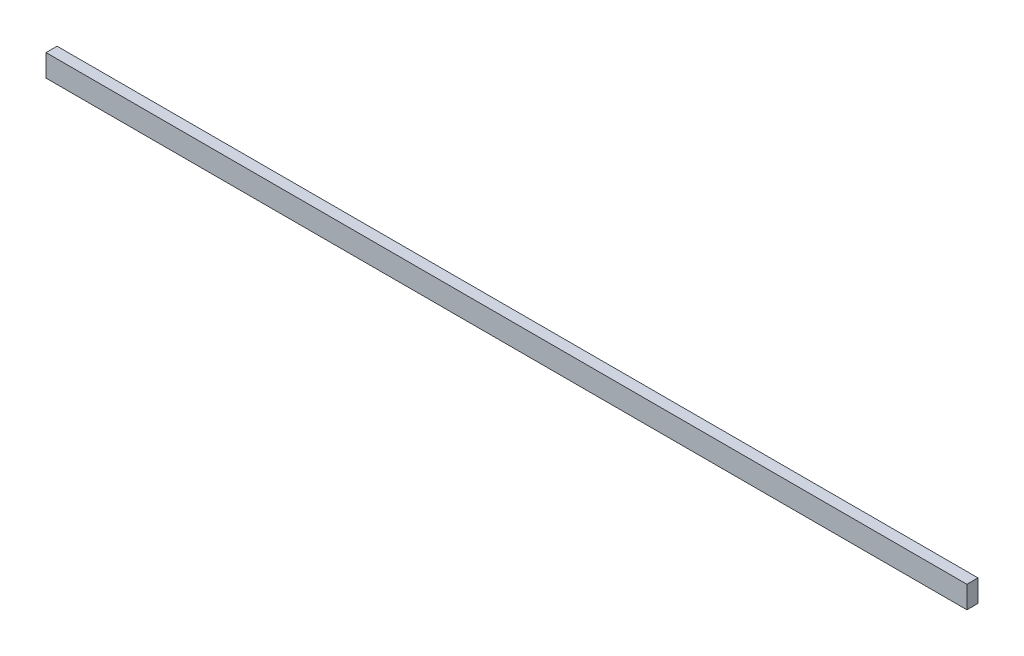
ISO-10303-21;
HEADER;
FILE_DESCRIPTION(('STEP AP214'),'2;1');
FILE_NAME('part.step','',(''),(''),'','','');
FILE_SCHEMA(('AUTOMOTIVE_DESIGN { 1 0 10303 214 1 1 1 1 }'));
ENDSEC;
DATA;
#1=APPLICATION_CONTEXT('core data for automotive mechanical design processes');
#2=APPLICATION_PROTOCOL_DEFINITION('international standard','automotive_design',2000,#1);
#3=PRODUCT_CONTEXT('',#1,'mechanical');
#4=PRODUCT('Part','Part','',(#3));
#5=PRODUCT_RELATED_PRODUCT_CATEGORY('part','',(#4));
#6=PRODUCT_DEFINITION_FORMATION('','',#4);
#7=PRODUCT_DEFINITION_CONTEXT('part definition',#1,'design');
#8=PRODUCT_DEFINITION('design','',#6,#7);
#9=PRODUCT_DEFINITION_SHAPE('','',#8);
#10=(LENGTH_UNIT() NAMED_UNIT(*) SI_UNIT(.MILLI.,.METRE.));
#11=(NAMED_UNIT(*) PLANE_ANGLE_UNIT() SI_UNIT($,.RADIAN.));
#12=(NAMED_UNIT(*) SI_UNIT($,.STERADIAN.) SOLID_ANGLE_UNIT());
#13=UNCERTAINTY_MEASURE_WITH_UNIT(LENGTH_MEASURE(1.E-05),#10,'distance_accuracy_value','');
#14=(GEOMETRIC_REPRESENTATION_CONTEXT(3) GLOBAL_UNCERTAINTY_ASSIGNED_CONTEXT((#13)) GLOBAL_UNIT_ASSIGNED_CONTEXT((#10,
#11,#12)) REPRESENTATION_CONTEXT('',''));
#15=CARTESIAN_POINT('',(0.,0.,0.));
#16=DIRECTION('',(0.,0.,1.));
#17=DIRECTION('',(1.,0.,0.));
#18=AXIS2_PLACEMENT_3D('',#15,#16,#17);
#19=CARTESIAN_POINT('',(208.,5.,5.));
#20=DIRECTION('',(-1.,0.,0.));
#21=DIRECTION('',(0.,0.,1.));
#22=AXIS2_PLACEMENT_3D('',#19,#20,#21);
#23=PLANE('',#22);
#24=DIRECTION('',(0.,1.,0.));
#25=VECTOR('',#24,1.);
#26=CARTESIAN_POINT('',(208.,5.,0.));
#27=LINE('',#26,#25);
#28=CARTESIAN_POINT('',(208.,-5.,0.));
#29=VERTEX_POINT('',#28);
#30=CARTESIAN_POINT('',(208.,5.,0.));
#31=VERTEX_POINT('',#30);
#32=EDGE_CURVE('E96',#29,#31,#27,.T.);
#33=ORIENTED_EDGE('',*,*,#32,.T.);
#34=DIRECTION('',(0.,0.,-1.));
#35=VECTOR('',#34,1.);
#36=CARTESIAN_POINT('',(208.,5.,5.));
#37=LINE('',#36,#35);
#38=CARTESIAN_POINT('',(208.,5.,5.));
#39=VERTEX_POINT('',#38);
#40=EDGE_CURVE('E11',#39,#31,#37,.T.);
#41=ORIENTED_EDGE('',*,*,#40,.F.);
#42=DIRECTION('',(0.,1.,0.));
#43=VECTOR('',#42,1.);
#44=CARTESIAN_POINT('',(208.,5.,5.));
#45=LINE('',#44,#43);
#46=CARTESIAN_POINT('',(208.,-5.,5.));
#47=VERTEX_POINT('',#46);
#48=EDGE_CURVE('E84',#47,#39,#45,.T.);
#49=ORIENTED_EDGE('',*,*,#48,.F.);
#50=DIRECTION('',(0.,0.,-1.));
#51=VECTOR('',#50,1.);
#52=CARTESIAN_POINT('',(208.,-5.,5.));
#53=LINE('',#52,#51);
#54=EDGE_CURVE('E92',#47,#29,#53,.T.);
#55=ORIENTED_EDGE('',*,*,#54,.T.);
#56=EDGE_LOOP('',(#33,#41,#49,#55));
#57=FACE_BOUND('',#56,.T.);
#58=ADVANCED_FACE('F33',(#57),#23,.F.);
#59=CARTESIAN_POINT('',(-208.,5.,5.));
#60=DIRECTION('',(0.,-1.,0.));
#61=DIRECTION('',(0.,0.,-1.));
#62=AXIS2_PLACEMENT_3D('',#59,#60,#61);
#63=PLANE('',#62);
#64=DIRECTION('',(-1.,0.,0.));
#65=VECTOR('',#64,1.);
#66=CARTESIAN_POINT('',(-208.,5.,0.));
#67=LINE('',#66,#65);
#68=CARTESIAN_POINT('',(-208.,5.,0.));
#69=VERTEX_POINT('',#68);
#70=EDGE_CURVE('E88',#31,#69,#67,.T.);
#71=ORIENTED_EDGE('',*,*,#70,.T.);
#72=DIRECTION('',(0.,0.,-1.));
#73=VECTOR('',#72,1.);
#74=CARTESIAN_POINT('',(-208.,5.,5.));
#75=LINE('',#74,#73);
#76=CARTESIAN_POINT('',(-208.,5.,5.));
#77=VERTEX_POINT('',#76);
#78=EDGE_CURVE('E41',#77,#69,#75,.T.);
#79=ORIENTED_EDGE('',*,*,#78,.F.);
#80=DIRECTION('',(-1.,0.,0.));
#81=VECTOR('',#80,1.);
#82=CARTESIAN_POINT('',(-208.,5.,5.));
#83=LINE('',#82,#81);
#84=EDGE_CURVE('E79',#39,#77,#83,.T.);
#85=ORIENTED_EDGE('',*,*,#84,.F.);
#86=ORIENTED_EDGE('',*,*,#40,.T.);
#87=EDGE_LOOP('',(#71,#79,#85,#86));
#88=FACE_BOUND('',#87,.T.);
#89=ADVANCED_FACE('F87',(#88),#63,.F.);
#90=CARTESIAN_POINT('',(-208.,5.,5.));
#91=DIRECTION('',(1.,0.,0.));
#92=DIRECTION('',(0.,0.,-1.));
#93=AXIS2_PLACEMENT_3D('',#90,#91,#92);
#94=PLANE('',#93);
#95=DIRECTION('',(0.,-1.,0.));
#96=VECTOR('',#95,1.);
#97=CARTESIAN_POINT('',(-208.,5.,0.));
#98=LINE('',#97,#96);
#99=CARTESIAN_POINT('',(-208.,-5.,0.));
#100=VERTEX_POINT('',#99);
#101=EDGE_CURVE('E66',#69,#100,#98,.T.);
#102=ORIENTED_EDGE('',*,*,#101,.T.);
#103=DIRECTION('',(0.,0.,-1.));
#104=VECTOR('',#103,1.);
#105=CARTESIAN_POINT('',(-208.,-5.,5.));
#106=LINE('',#105,#104);
#107=CARTESIAN_POINT('',(-208.,-5.,5.));
#108=VERTEX_POINT('',#107);
#109=EDGE_CURVE('E89',#108,#100,#106,.T.);
#110=ORIENTED_EDGE('',*,*,#109,.F.);
#111=DIRECTION('',(0.,-1.,0.));
#112=VECTOR('',#111,1.);
#113=CARTESIAN_POINT('',(-208.,5.,5.));
#114=LINE('',#113,#112);
#115=EDGE_CURVE('E82',#77,#108,#114,.T.);
#116=ORIENTED_EDGE('',*,*,#115,.F.);
#117=ORIENTED_EDGE('',*,*,#78,.T.);
#118=EDGE_LOOP('',(#102,#110,#116,#117));
#119=FACE_BOUND('',#118,.T.);
#120=ADVANCED_FACE('F90',(#119),#94,.F.);
#121=CARTESIAN_POINT('',(-208.,-5.,5.));
#122=DIRECTION('',(0.,1.,0.));
#123=DIRECTION('',(0.,0.,1.));
#124=AXIS2_PLACEMENT_3D('',#121,#122,#123);
#125=PLANE('',#124);
#126=DIRECTION('',(1.,0.,0.));
#127=VECTOR('',#126,1.);
#128=CARTESIAN_POINT('',(-208.,-5.,0.));
#129=LINE('',#128,#127);
#130=EDGE_CURVE('E72',#100,#29,#129,.T.);
#131=ORIENTED_EDGE('',*,*,#130,.T.);
#132=ORIENTED_EDGE('',*,*,#54,.F.);
#133=DIRECTION('',(1.,0.,0.));
#134=VECTOR('',#133,1.);
#135=CARTESIAN_POINT('',(-208.,-5.,5.));
#136=LINE('',#135,#134);
#137=EDGE_CURVE('E49',#108,#47,#136,.T.);
#138=ORIENTED_EDGE('',*,*,#137,.F.);
#139=ORIENTED_EDGE('',*,*,#109,.T.);
#140=EDGE_LOOP('',(#131,#132,#138,#139));
#141=FACE_BOUND('',#140,.T.);
#142=ADVANCED_FACE('F103',(#141),#125,.F.);
#143=CARTESIAN_POINT('',(0.,0.,5.));
#144=DIRECTION('',(0.,0.,1.));
#145=DIRECTION('',(1.,0.,0.));
#146=AXIS2_PLACEMENT_3D('',#143,#144,#145);
#147=PLANE('',#146);
#148=ORIENTED_EDGE('',*,*,#48,.T.);
#149=ORIENTED_EDGE('',*,*,#84,.T.);
#150=ORIENTED_EDGE('',*,*,#115,.T.);
#151=ORIENTED_EDGE('',*,*,#137,.T.);
#152=EDGE_LOOP('',(#148,#149,#150,#151));
#153=FACE_BOUND('',#152,.T.);
#154=ADVANCED_FACE('F80',(#153),#147,.T.);
#155=CARTESIAN_POINT('',(0.,0.,0.));
#156=DIRECTION('',(0.,0.,1.));
#157=DIRECTION('',(1.,0.,0.));
#158=AXIS2_PLACEMENT_3D('',#155,#156,#157);
#159=PLANE('',#158);
#160=ORIENTED_EDGE('',*,*,#32,.F.);
#161=ORIENTED_EDGE('',*,*,#130,.F.);
#162=ORIENTED_EDGE('',*,*,#101,.F.);
#163=ORIENTED_EDGE('',*,*,#70,.F.);
#164=EDGE_LOOP('',(#160,#161,#162,#163));
#165=FACE_BOUND('',#164,.T.);
#166=ADVANCED_FACE('F106',(#165),#159,.F.);
#167=CLOSED_SHELL('',(#58,#89,#120,#142,#154,#166));
#168=MANIFOLD_SOLID_BREP('B2',#167);
#169=ADVANCED_BREP_SHAPE_REPRESENTATION('',(#18,#168),#14);
#170=SHAPE_DEFINITION_REPRESENTATION(#9,#169);
ENDSEC;
END-ISO-10303-21;
